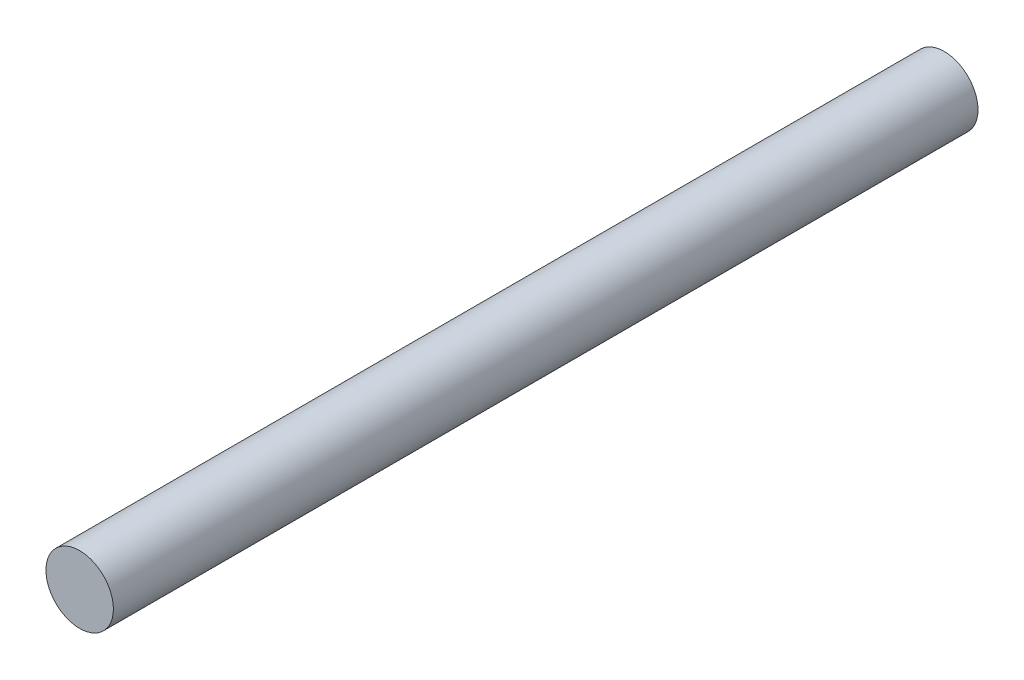
ISO-10303-21;
HEADER;
FILE_DESCRIPTION(('STEP AP214'),'2;1');
FILE_NAME('part.step','',(''),(''),'','','');
FILE_SCHEMA(('AUTOMOTIVE_DESIGN { 1 0 10303 214 1 1 1 1 }'));
ENDSEC;
DATA;
#1=APPLICATION_CONTEXT('core data for automotive mechanical design processes');
#2=APPLICATION_PROTOCOL_DEFINITION('international standard','automotive_design',2000,#1);
#3=PRODUCT_CONTEXT('',#1,'mechanical');
#4=PRODUCT('Part','Part','',(#3));
#5=PRODUCT_RELATED_PRODUCT_CATEGORY('part','',(#4));
#6=PRODUCT_DEFINITION_FORMATION('','',#4);
#7=PRODUCT_DEFINITION_CONTEXT('part definition',#1,'design');
#8=PRODUCT_DEFINITION('design','',#6,#7);
#9=PRODUCT_DEFINITION_SHAPE('','',#8);
#10=(LENGTH_UNIT() NAMED_UNIT(*) SI_UNIT(.MILLI.,.METRE.));
#11=(NAMED_UNIT(*) PLANE_ANGLE_UNIT() SI_UNIT($,.RADIAN.));
#12=(NAMED_UNIT(*) SI_UNIT($,.STERADIAN.) SOLID_ANGLE_UNIT());
#13=UNCERTAINTY_MEASURE_WITH_UNIT(LENGTH_MEASURE(1.E-05),#10,'distance_accuracy_value','');
#14=(GEOMETRIC_REPRESENTATION_CONTEXT(3) GLOBAL_UNCERTAINTY_ASSIGNED_CONTEXT((#13)) GLOBAL_UNIT_ASSIGNED_CONTEXT((#10,
#11,#12)) REPRESENTATION_CONTEXT('',''));
#15=CARTESIAN_POINT('',(0.,0.,0.));
#16=DIRECTION('',(0.,0.,1.));
#17=DIRECTION('',(1.,0.,0.));
#18=AXIS2_PLACEMENT_3D('',#15,#16,#17);
#19=CARTESIAN_POINT('',(0.,0.,500.));
#20=DIRECTION('',(0.,0.,-1.));
#21=DIRECTION('',(-1.,0.,0.));
#22=AXIS2_PLACEMENT_3D('',#19,#20,#21);
#23=CYLINDRICAL_SURFACE('',#22,39.);
#24=CARTESIAN_POINT('',(0.,0.,500.));
#25=DIRECTION('',(0.,0.,1.));
#26=DIRECTION('',(1.,0.,0.));
#27=AXIS2_PLACEMENT_3D('',#24,#25,#26);
#28=CIRCLE('',#27,39.);
#29=CARTESIAN_POINT('',(39.,0.,500.));
#30=VERTEX_POINT('',#29);
#31=EDGE_CURVE('E10',#30,#30,#28,.T.);
#32=ORIENTED_EDGE('',*,*,#31,.F.);
#33=EDGE_LOOP('',(#32));
#34=FACE_BOUND('',#33,.T.);
#35=CARTESIAN_POINT('',(0.,0.,-500.));
#36=DIRECTION('',(0.,0.,1.));
#37=DIRECTION('',(1.,0.,0.));
#38=AXIS2_PLACEMENT_3D('',#35,#36,#37);
#39=CIRCLE('',#38,39.);
#40=CARTESIAN_POINT('',(39.,0.,-500.));
#41=VERTEX_POINT('',#40);
#42=EDGE_CURVE('E38',#41,#41,#39,.T.);
#43=ORIENTED_EDGE('',*,*,#42,.T.);
#44=EDGE_LOOP('',(#43));
#45=FACE_BOUND('',#44,.T.);
#46=ADVANCED_FACE('F35',(#34,#45),#23,.T.);
#47=CARTESIAN_POINT('',(0.,0.,500.));
#48=DIRECTION('',(0.,0.,1.));
#49=DIRECTION('',(1.,0.,0.));
#50=AXIS2_PLACEMENT_3D('',#47,#48,#49);
#51=PLANE('',#50);
#52=ORIENTED_EDGE('',*,*,#31,.T.);
#53=EDGE_LOOP('',(#52));
#54=FACE_BOUND('',#53,.T.);
#55=ADVANCED_FACE('F50',(#54),#51,.T.);
#56=CARTESIAN_POINT('',(0.,0.,-500.));
#57=DIRECTION('',(0.,0.,1.));
#58=DIRECTION('',(1.,0.,0.));
#59=AXIS2_PLACEMENT_3D('',#56,#57,#58);
#60=PLANE('',#59);
#61=ORIENTED_EDGE('',*,*,#42,.F.);
#62=EDGE_LOOP('',(#61));
#63=FACE_BOUND('',#62,.T.);
#64=ADVANCED_FACE('F48',(#63),#60,.F.);
#65=CLOSED_SHELL('',(#46,#55,#64));
#66=MANIFOLD_SOLID_BREP('B2',#65);
#67=ADVANCED_BREP_SHAPE_REPRESENTATION('',(#18,#66),#14);
#68=SHAPE_DEFINITION_REPRESENTATION(#9,#67);
ENDSEC;
END-ISO-10303-21;
